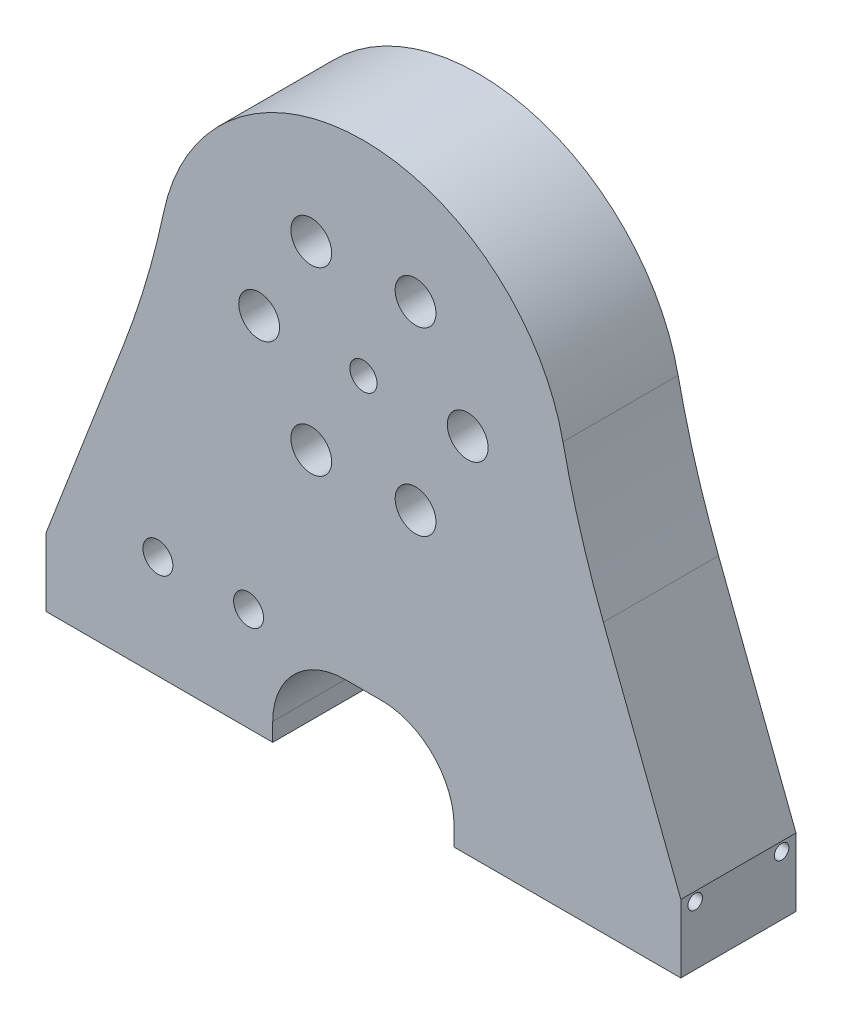
ISO-10303-21;
HEADER;
FILE_DESCRIPTION(('STEP AP214'),'2;1');
FILE_NAME('part.step','',(''),(''),'','','');
FILE_SCHEMA(('AUTOMOTIVE_DESIGN { 1 0 10303 214 1 1 1 1 }'));
ENDSEC;
DATA;
#1=APPLICATION_CONTEXT('core data for automotive mechanical design processes');
#2=APPLICATION_PROTOCOL_DEFINITION('international standard','automotive_design',2000,#1);
#3=PRODUCT_CONTEXT('',#1,'mechanical');
#4=PRODUCT('Part','Part','',(#3));
#5=PRODUCT_RELATED_PRODUCT_CATEGORY('part','',(#4));
#6=PRODUCT_DEFINITION_FORMATION('','',#4);
#7=PRODUCT_DEFINITION_CONTEXT('part definition',#1,'design');
#8=PRODUCT_DEFINITION('design','',#6,#7);
#9=PRODUCT_DEFINITION_SHAPE('','',#8);
#10=(LENGTH_UNIT() NAMED_UNIT(*) SI_UNIT(.MILLI.,.METRE.));
#11=(NAMED_UNIT(*) PLANE_ANGLE_UNIT() SI_UNIT($,.RADIAN.));
#12=(NAMED_UNIT(*) SI_UNIT($,.STERADIAN.) SOLID_ANGLE_UNIT());
#13=UNCERTAINTY_MEASURE_WITH_UNIT(LENGTH_MEASURE(1.E-05),#10,'distance_accuracy_value','');
#14=(GEOMETRIC_REPRESENTATION_CONTEXT(3) GLOBAL_UNCERTAINTY_ASSIGNED_CONTEXT((#13)) GLOBAL_UNIT_ASSIGNED_CONTEXT((#10,
#11,#12)) REPRESENTATION_CONTEXT('',''));
#15=CARTESIAN_POINT('',(0.,0.,0.));
#16=DIRECTION('',(0.,0.,1.));
#17=DIRECTION('',(1.,0.,0.));
#18=AXIS2_PLACEMENT_3D('',#15,#16,#17);
#19=CARTESIAN_POINT('',(35.,-35.,6.35));
#20=DIRECTION('',(0.,1.,0.));
#21=DIRECTION('',(-1.,0.,0.));
#22=AXIS2_PLACEMENT_3D('',#19,#20,#21);
#23=PLANE('',#22);
#24=CARTESIAN_POINT('',(27.5,-35.,0.));
#25=DIRECTION('',(0.,-1.,0.));
#26=DIRECTION('',(0.,0.,-1.));
#27=AXIS2_PLACEMENT_3D('',#24,#25,#26);
#28=CIRCLE('',#27,1.65);
#29=CARTESIAN_POINT('',(27.5,-35.,-1.65));
#30=VERTEX_POINT('',#29);
#31=EDGE_CURVE('E207',#30,#30,#28,.T.);
#32=ORIENTED_EDGE('',*,*,#31,.F.);
#33=EDGE_LOOP('',(#32));
#34=FACE_BOUND('',#33,.T.);
#35=CARTESIAN_POINT('',(17.5,-35.,0.));
#36=DIRECTION('',(0.,-1.,0.));
#37=DIRECTION('',(0.,0.,-1.));
#38=AXIS2_PLACEMENT_3D('',#35,#36,#37);
#39=CIRCLE('',#38,1.65);
#40=CARTESIAN_POINT('',(17.5,-35.,-1.65));
#41=VERTEX_POINT('',#40);
#42=EDGE_CURVE('E213',#41,#41,#39,.T.);
#43=ORIENTED_EDGE('',*,*,#42,.F.);
#44=EDGE_LOOP('',(#43));
#45=FACE_BOUND('',#44,.T.);
#46=DIRECTION('',(1.,0.,0.));
#47=VECTOR('',#46,1.);
#48=CARTESIAN_POINT('',(35.,-35.,6.35));
#49=LINE('',#48,#47);
#50=CARTESIAN_POINT('',(10.,-35.,6.35));
#51=VERTEX_POINT('',#50);
#52=CARTESIAN_POINT('',(35.,-35.,6.35));
#53=VERTEX_POINT('',#52);
#54=EDGE_CURVE('E336',#51,#53,#49,.T.);
#55=ORIENTED_EDGE('',*,*,#54,.F.);
#56=DIRECTION('',(0.,0.,-1.));
#57=VECTOR('',#56,1.);
#58=CARTESIAN_POINT('',(10.,-35.,6.35));
#59=LINE('',#58,#57);
#60=CARTESIAN_POINT('',(10.,-35.,-6.35));
#61=VERTEX_POINT('',#60);
#62=EDGE_CURVE('E246',#51,#61,#59,.T.);
#63=ORIENTED_EDGE('',*,*,#62,.T.);
#64=DIRECTION('',(1.,0.,0.));
#65=VECTOR('',#64,1.);
#66=CARTESIAN_POINT('',(35.,-35.,-6.35));
#67=LINE('',#66,#65);
#68=CARTESIAN_POINT('',(35.,-35.,-6.35));
#69=VERTEX_POINT('',#68);
#70=EDGE_CURVE('E346',#61,#69,#67,.T.);
#71=ORIENTED_EDGE('',*,*,#70,.T.);
#72=DIRECTION('',(0.,0.,-1.));
#73=VECTOR('',#72,1.);
#74=CARTESIAN_POINT('',(35.,-35.,6.35));
#75=LINE('',#74,#73);
#76=EDGE_CURVE('E344',#53,#69,#75,.T.);
#77=ORIENTED_EDGE('',*,*,#76,.F.);
#78=EDGE_LOOP('',(#55,#63,#71,#77));
#79=FACE_BOUND('',#78,.T.);
#80=ADVANCED_FACE('F57',(#34,#45,#79),#23,.F.);
#81=CARTESIAN_POINT('',(35.,-35.,6.35));
#82=DIRECTION('',(-1.,0.,0.));
#83=DIRECTION('',(0.,0.,1.));
#84=AXIS2_PLACEMENT_3D('',#81,#82,#83);
#85=PLANE('',#84);
#86=CARTESIAN_POINT('',(35.,-28.5,4.765));
#87=DIRECTION('',(1.,0.,0.));
#88=DIRECTION('',(0.,0.,-1.));
#89=AXIS2_PLACEMENT_3D('',#86,#87,#88);
#90=CIRCLE('',#89,0.799999999999988);
#91=CARTESIAN_POINT('',(35.,-28.5,3.96500000000001));
#92=VERTEX_POINT('',#91);
#93=EDGE_CURVE('E185',#92,#92,#90,.T.);
#94=ORIENTED_EDGE('',*,*,#93,.F.);
#95=EDGE_LOOP('',(#94));
#96=FACE_BOUND('',#95,.T.);
#97=CARTESIAN_POINT('',(35.,-28.5,-4.765));
#98=DIRECTION('',(1.,0.,0.));
#99=DIRECTION('',(0.,0.,-1.));
#100=AXIS2_PLACEMENT_3D('',#97,#98,#99);
#101=CIRCLE('',#100,0.799999999999988);
#102=CARTESIAN_POINT('',(35.,-28.5,-5.56499999999999));
#103=VERTEX_POINT('',#102);
#104=EDGE_CURVE('E184',#103,#103,#101,.T.);
#105=ORIENTED_EDGE('',*,*,#104,.F.);
#106=EDGE_LOOP('',(#105));
#107=FACE_BOUND('',#106,.T.);
#108=DIRECTION('',(0.,0.,-1.));
#109=VECTOR('',#108,1.);
#110=CARTESIAN_POINT('',(35.,-27.5,6.35));
#111=LINE('',#110,#109);
#112=CARTESIAN_POINT('',(35.,-27.5,6.35));
#113=VERTEX_POINT('',#112);
#114=CARTESIAN_POINT('',(35.,-27.5,-6.35));
#115=VERTEX_POINT('',#114);
#116=EDGE_CURVE('E286',#113,#115,#111,.T.);
#117=ORIENTED_EDGE('',*,*,#116,.F.);
#118=DIRECTION('',(0.,1.,0.));
#119=VECTOR('',#118,1.);
#120=CARTESIAN_POINT('',(35.,-35.,6.35));
#121=LINE('',#120,#119);
#122=EDGE_CURVE('E341',#53,#113,#121,.T.);
#123=ORIENTED_EDGE('',*,*,#122,.F.);
#124=ORIENTED_EDGE('',*,*,#76,.T.);
#125=DIRECTION('',(0.,1.,0.));
#126=VECTOR('',#125,1.);
#127=CARTESIAN_POINT('',(35.,-35.,-6.35));
#128=LINE('',#127,#126);
#129=EDGE_CURVE('E337',#69,#115,#128,.T.);
#130=ORIENTED_EDGE('',*,*,#129,.T.);
#131=EDGE_LOOP('',(#117,#123,#124,#130));
#132=FACE_BOUND('',#131,.T.);
#133=ADVANCED_FACE('F427',(#96,#107,#132),#85,.F.);
#134=CARTESIAN_POINT('',(0.,0.,6.35));
#135=DIRECTION('',(0.,0.,1.));
#136=DIRECTION('',(1.,0.,0.));
#137=AXIS2_PLACEMENT_3D('',#134,#135,#136);
#138=PLANE('',#137);
#139=CARTESIAN_POINT('',(-12.6623879566888,-23.6249999999995,6.35));
#140=DIRECTION('',(0.,0.,-1.));
#141=DIRECTION('',(-1.,0.,0.));
#142=AXIS2_PLACEMENT_3D('',#139,#140,#141);
#143=CIRCLE('',#142,1.65);
#144=CARTESIAN_POINT('',(-14.3123879566888,-23.6249999999995,6.35));
#145=VERTEX_POINT('',#144);
#146=EDGE_CURVE('E198',#145,#145,#143,.T.);
#147=ORIENTED_EDGE('',*,*,#146,.T.);
#148=EDGE_LOOP('',(#147));
#149=FACE_BOUND('',#148,.T.);
#150=CARTESIAN_POINT('',(-22.6623879566888,-23.6249999999995,6.35));
#151=DIRECTION('',(0.,0.,-1.));
#152=DIRECTION('',(-1.,0.,0.));
#153=AXIS2_PLACEMENT_3D('',#150,#151,#152);
#154=CIRCLE('',#153,1.65);
#155=CARTESIAN_POINT('',(-24.3123879566888,-23.6249999999995,6.35));
#156=VERTEX_POINT('',#155);
#157=EDGE_CURVE('E204',#156,#156,#154,.T.);
#158=ORIENTED_EDGE('',*,*,#157,.T.);
#159=EDGE_LOOP('',(#158));
#160=FACE_BOUND('',#159,.T.);
#161=DIRECTION('',(0.,-1.,0.));
#162=VECTOR('',#161,1.);
#163=CARTESIAN_POINT('',(10.,-35.,6.35));
#164=LINE('',#163,#162);
#165=CARTESIAN_POINT('',(10.,-33.,6.35));
#166=VERTEX_POINT('',#165);
#167=EDGE_CURVE('E232',#166,#51,#164,.T.);
#168=ORIENTED_EDGE('',*,*,#167,.T.);
#169=ORIENTED_EDGE('',*,*,#54,.T.);
#170=ORIENTED_EDGE('',*,*,#122,.T.);
#171=DIRECTION('',(0.358979079308869,-0.93334560620306,0.));
#172=VECTOR('',#171,1.);
#173=CARTESIAN_POINT('',(21.2757731958763,8.18298969072165,6.35));
#174=LINE('',#173,#172);
#175=CARTESIAN_POINT('',(26.4605218334639,-5.29735676700612,6.35));
#176=VERTEX_POINT('',#175);
#177=EDGE_CURVE('E278',#176,#113,#174,.T.);
#178=ORIENTED_EDGE('',*,*,#177,.F.);
#179=CARTESIAN_POINT('',(119.79508245377,30.6005511638808,6.35));
#180=DIRECTION('',(0.,0.,1.));
#181=DIRECTION('',(1.,0.,0.));
#182=AXIS2_PLACEMENT_3D('',#179,#180,#181);
#183=CIRCLE('',#182,100.);
#184=CARTESIAN_POINT('',(22.0031784098761,9.70214205050871,6.35));
#185=VERTEX_POINT('',#184);
#186=EDGE_CURVE('E11',#176,#185,#183,.F.);
#187=ORIENTED_EDGE('',*,*,#186,.T.);
#188=CARTESIAN_POINT('',(0.,4.99999999999999,6.35));
#189=DIRECTION('',(0.,0.,-1.));
#190=DIRECTION('',(-1.,0.,0.));
#191=AXIS2_PLACEMENT_3D('',#188,#189,#190);
#192=CIRCLE('',#191,22.5);
#193=CARTESIAN_POINT('',(-22.0031784098761,9.70214205050871,6.35));
#194=VERTEX_POINT('',#193);
#195=EDGE_CURVE('E272',#194,#185,#192,.T.);
#196=ORIENTED_EDGE('',*,*,#195,.F.);
#197=CARTESIAN_POINT('',(-119.79508245377,30.6005511638808,6.35));
#198=DIRECTION('',(0.,0.,1.));
#199=DIRECTION('',(1.,0.,0.));
#200=AXIS2_PLACEMENT_3D('',#197,#198,#199);
#201=CIRCLE('',#200,100.);
#202=CARTESIAN_POINT('',(-26.4605218334639,-5.29735676700612,6.35));
#203=VERTEX_POINT('',#202);
#204=EDGE_CURVE('E368',#194,#203,#201,.F.);
#205=ORIENTED_EDGE('',*,*,#204,.T.);
#206=DIRECTION('',(-0.358979079308869,-0.93334560620306,0.));
#207=VECTOR('',#206,1.);
#208=CARTESIAN_POINT('',(-21.2757731958763,8.18298969072165,6.35));
#209=LINE('',#208,#207);
#210=CARTESIAN_POINT('',(-35.,-27.5,6.35));
#211=VERTEX_POINT('',#210);
#212=EDGE_CURVE('E275',#203,#211,#209,.T.);
#213=ORIENTED_EDGE('',*,*,#212,.T.);
#214=DIRECTION('',(0.,-1.,0.));
#215=VECTOR('',#214,1.);
#216=CARTESIAN_POINT('',(-35.,-35.,6.35));
#217=LINE('',#216,#215);
#218=CARTESIAN_POINT('',(-35.,-35.,6.35));
#219=VERTEX_POINT('',#218);
#220=EDGE_CURVE('E334',#211,#219,#217,.T.);
#221=ORIENTED_EDGE('',*,*,#220,.T.);
#222=CARTESIAN_POINT('',(-10.,-35.,6.35));
#223=VERTEX_POINT('',#222);
#224=EDGE_CURVE('E338',#219,#223,#49,.T.);
#225=ORIENTED_EDGE('',*,*,#224,.T.);
#226=DIRECTION('',(0.,1.,0.));
#227=VECTOR('',#226,1.);
#228=CARTESIAN_POINT('',(-10.,-35.,6.35));
#229=LINE('',#228,#227);
#230=CARTESIAN_POINT('',(-10.,-33.,6.35));
#231=VERTEX_POINT('',#230);
#232=EDGE_CURVE('E72',#223,#231,#229,.T.);
#233=ORIENTED_EDGE('',*,*,#232,.T.);
#234=CARTESIAN_POINT('',(-2.,-33.,6.35));
#235=DIRECTION('',(0.,0.,-1.));
#236=DIRECTION('',(1.,0.,0.));
#237=AXIS2_PLACEMENT_3D('',#234,#235,#236);
#238=CIRCLE('',#237,8.);
#239=CARTESIAN_POINT('',(-2.,-25.,6.35));
#240=VERTEX_POINT('',#239);
#241=EDGE_CURVE('E237',#231,#240,#238,.T.);
#242=ORIENTED_EDGE('',*,*,#241,.T.);
#243=DIRECTION('',(1.,0.,0.));
#244=VECTOR('',#243,1.);
#245=CARTESIAN_POINT('',(2.,-25.,6.35));
#246=LINE('',#245,#244);
#247=CARTESIAN_POINT('',(2.,-25.,6.35));
#248=VERTEX_POINT('',#247);
#249=EDGE_CURVE('E240',#240,#248,#246,.T.);
#250=ORIENTED_EDGE('',*,*,#249,.T.);
#251=CARTESIAN_POINT('',(2.,-33.,6.35));
#252=DIRECTION('',(0.,0.,-1.));
#253=DIRECTION('',(1.,0.,0.));
#254=AXIS2_PLACEMENT_3D('',#251,#252,#253);
#255=CIRCLE('',#254,8.);
#256=EDGE_CURVE('E243',#248,#166,#255,.T.);
#257=ORIENTED_EDGE('',*,*,#256,.T.);
#258=EDGE_LOOP('',(#168,#169,#170,#178,#187,#196,#205,#213,#221,#225,#233,#242,#250,#257));
#259=FACE_BOUND('',#258,.T.);
#260=CARTESIAN_POINT('',(-5.74999999999991,14.9592921435211,6.35));
#261=DIRECTION('',(0.,0.,-1.));
#262=DIRECTION('',(-1.,0.,0.));
#263=AXIS2_PLACEMENT_3D('',#260,#261,#262);
#264=CIRCLE('',#263,2.25);
#265=CARTESIAN_POINT('',(-7.99999999999991,14.9592921435211,6.35));
#266=VERTEX_POINT('',#265);
#267=EDGE_CURVE('E294',#266,#266,#264,.T.);
#268=ORIENTED_EDGE('',*,*,#267,.T.);
#269=EDGE_LOOP('',(#268));
#270=FACE_BOUND('',#269,.T.);
#271=CARTESIAN_POINT('',(5.75000000000012,14.959292143521,6.35));
#272=DIRECTION('',(0.,0.,-1.));
#273=DIRECTION('',(-1.,0.,0.));
#274=AXIS2_PLACEMENT_3D('',#271,#272,#273);
#275=CIRCLE('',#274,2.25);
#276=CARTESIAN_POINT('',(3.50000000000012,14.959292143521,6.35));
#277=VERTEX_POINT('',#276);
#278=EDGE_CURVE('E300',#277,#277,#275,.T.);
#279=ORIENTED_EDGE('',*,*,#278,.T.);
#280=EDGE_LOOP('',(#279));
#281=FACE_BOUND('',#280,.T.);
#282=CARTESIAN_POINT('',(11.5,4.99999999999998,6.35));
#283=DIRECTION('',(0.,0.,-1.));
#284=DIRECTION('',(-1.,0.,0.));
#285=AXIS2_PLACEMENT_3D('',#282,#283,#284);
#286=CIRCLE('',#285,2.25);
#287=CARTESIAN_POINT('',(9.25,4.99999999999998,6.35));
#288=VERTEX_POINT('',#287);
#289=EDGE_CURVE('E306',#288,#288,#286,.T.);
#290=ORIENTED_EDGE('',*,*,#289,.T.);
#291=EDGE_LOOP('',(#290));
#292=FACE_BOUND('',#291,.T.);
#293=CARTESIAN_POINT('',(5.75,-4.95929214352108,6.35));
#294=DIRECTION('',(0.,0.,-1.));
#295=DIRECTION('',(-1.,0.,0.));
#296=AXIS2_PLACEMENT_3D('',#293,#294,#295);
#297=CIRCLE('',#296,2.25);
#298=CARTESIAN_POINT('',(3.5,-4.95929214352108,6.35));
#299=VERTEX_POINT('',#298);
#300=EDGE_CURVE('E312',#299,#299,#297,.T.);
#301=ORIENTED_EDGE('',*,*,#300,.T.);
#302=EDGE_LOOP('',(#301));
#303=FACE_BOUND('',#302,.T.);
#304=CARTESIAN_POINT('',(-5.75,-4.95929214352104,6.35));
#305=DIRECTION('',(0.,0.,-1.));
#306=DIRECTION('',(-1.,0.,0.));
#307=AXIS2_PLACEMENT_3D('',#304,#305,#306);
#308=CIRCLE('',#307,2.25);
#309=CARTESIAN_POINT('',(-8.,-4.95929214352104,6.35));
#310=VERTEX_POINT('',#309);
#311=EDGE_CURVE('E318',#310,#310,#308,.T.);
#312=ORIENTED_EDGE('',*,*,#311,.T.);
#313=EDGE_LOOP('',(#312));
#314=FACE_BOUND('',#313,.T.);
#315=CARTESIAN_POINT('',(-11.5,5.00000000000006,6.35));
#316=DIRECTION('',(0.,0.,-1.));
#317=DIRECTION('',(-1.,0.,0.));
#318=AXIS2_PLACEMENT_3D('',#315,#316,#317);
#319=CIRCLE('',#318,2.25);
#320=CARTESIAN_POINT('',(-13.75,5.00000000000006,6.35));
#321=VERTEX_POINT('',#320);
#322=EDGE_CURVE('E324',#321,#321,#319,.T.);
#323=ORIENTED_EDGE('',*,*,#322,.T.);
#324=EDGE_LOOP('',(#323));
#325=FACE_BOUND('',#324,.T.);
#326=CARTESIAN_POINT('',(0.,4.99999999999999,6.35));
#327=DIRECTION('',(0.,0.,-1.));
#328=DIRECTION('',(-1.,0.,0.));
#329=AXIS2_PLACEMENT_3D('',#326,#327,#328);
#330=CIRCLE('',#329,1.5);
#331=CARTESIAN_POINT('',(-1.5,4.99999999999999,6.35));
#332=VERTEX_POINT('',#331);
#333=EDGE_CURVE('E328',#332,#332,#330,.T.);
#334=ORIENTED_EDGE('',*,*,#333,.T.);
#335=EDGE_LOOP('',(#334));
#336=FACE_BOUND('',#335,.T.);
#337=ADVANCED_FACE('F381',(#149,#160,#259,#270,#281,#292,#303,#314,#325,#336),#138,.T.);
#338=CARTESIAN_POINT('',(0.,0.,-6.35));
#339=DIRECTION('',(0.,0.,1.));
#340=DIRECTION('',(1.,0.,0.));
#341=AXIS2_PLACEMENT_3D('',#338,#339,#340);
#342=PLANE('',#341);
#343=CARTESIAN_POINT('',(-12.6623879566888,-23.6249999999995,-6.35));
#344=DIRECTION('',(0.,0.,-1.));
#345=DIRECTION('',(-1.,0.,0.));
#346=AXIS2_PLACEMENT_3D('',#343,#344,#345);
#347=CIRCLE('',#346,1.65);
#348=CARTESIAN_POINT('',(-14.3123879566888,-23.6249999999995,-6.35));
#349=VERTEX_POINT('',#348);
#350=EDGE_CURVE('E195',#349,#349,#347,.T.);
#351=ORIENTED_EDGE('',*,*,#350,.F.);
#352=EDGE_LOOP('',(#351));
#353=FACE_BOUND('',#352,.T.);
#354=CARTESIAN_POINT('',(-22.6623879566888,-23.6249999999995,-6.35));
#355=DIRECTION('',(0.,0.,-1.));
#356=DIRECTION('',(-1.,0.,0.));
#357=AXIS2_PLACEMENT_3D('',#354,#355,#356);
#358=CIRCLE('',#357,1.65);
#359=CARTESIAN_POINT('',(-24.3123879566888,-23.6249999999995,-6.35));
#360=VERTEX_POINT('',#359);
#361=EDGE_CURVE('E201',#360,#360,#358,.T.);
#362=ORIENTED_EDGE('',*,*,#361,.F.);
#363=EDGE_LOOP('',(#362));
#364=FACE_BOUND('',#363,.T.);
#365=CARTESIAN_POINT('',(0.,4.99999999999999,-6.35));
#366=DIRECTION('',(0.,0.,-1.));
#367=DIRECTION('',(-1.,0.,0.));
#368=AXIS2_PLACEMENT_3D('',#365,#366,#367);
#369=CIRCLE('',#368,1.5);
#370=CARTESIAN_POINT('',(-1.5,4.99999999999999,-6.35));
#371=VERTEX_POINT('',#370);
#372=EDGE_CURVE('E327',#371,#371,#369,.T.);
#373=ORIENTED_EDGE('',*,*,#372,.F.);
#374=EDGE_LOOP('',(#373));
#375=FACE_BOUND('',#374,.T.);
#376=CARTESIAN_POINT('',(-11.5,5.00000000000006,-6.35));
#377=DIRECTION('',(0.,0.,-1.));
#378=DIRECTION('',(-1.,0.,0.));
#379=AXIS2_PLACEMENT_3D('',#376,#377,#378);
#380=CIRCLE('',#379,2.24999999999999);
#381=CARTESIAN_POINT('',(-13.75,5.00000000000006,-6.35));
#382=VERTEX_POINT('',#381);
#383=EDGE_CURVE('E321',#382,#382,#380,.T.);
#384=ORIENTED_EDGE('',*,*,#383,.F.);
#385=EDGE_LOOP('',(#384));
#386=FACE_BOUND('',#385,.T.);
#387=CARTESIAN_POINT('',(-5.75,-4.95929214352104,-6.35));
#388=DIRECTION('',(0.,0.,-1.));
#389=DIRECTION('',(-1.,0.,0.));
#390=AXIS2_PLACEMENT_3D('',#387,#388,#389);
#391=CIRCLE('',#390,2.24999999999999);
#392=CARTESIAN_POINT('',(-7.99999999999999,-4.95929214352104,-6.35));
#393=VERTEX_POINT('',#392);
#394=EDGE_CURVE('E315',#393,#393,#391,.T.);
#395=ORIENTED_EDGE('',*,*,#394,.F.);
#396=EDGE_LOOP('',(#395));
#397=FACE_BOUND('',#396,.T.);
#398=CARTESIAN_POINT('',(5.75,-4.95929214352108,-6.35));
#399=DIRECTION('',(0.,0.,-1.));
#400=DIRECTION('',(-1.,0.,0.));
#401=AXIS2_PLACEMENT_3D('',#398,#399,#400);
#402=CIRCLE('',#401,2.24999999999999);
#403=CARTESIAN_POINT('',(3.50000000000001,-4.95929214352108,-6.35));
#404=VERTEX_POINT('',#403);
#405=EDGE_CURVE('E309',#404,#404,#402,.T.);
#406=ORIENTED_EDGE('',*,*,#405,.F.);
#407=EDGE_LOOP('',(#406));
#408=FACE_BOUND('',#407,.T.);
#409=CARTESIAN_POINT('',(11.5,4.99999999999998,-6.35));
#410=DIRECTION('',(0.,0.,-1.));
#411=DIRECTION('',(-1.,0.,0.));
#412=AXIS2_PLACEMENT_3D('',#409,#410,#411);
#413=CIRCLE('',#412,2.24999999999999);
#414=CARTESIAN_POINT('',(9.25000000000001,4.99999999999998,-6.35));
#415=VERTEX_POINT('',#414);
#416=EDGE_CURVE('E303',#415,#415,#413,.T.);
#417=ORIENTED_EDGE('',*,*,#416,.F.);
#418=EDGE_LOOP('',(#417));
#419=FACE_BOUND('',#418,.T.);
#420=CARTESIAN_POINT('',(5.75000000000012,14.959292143521,-6.35));
#421=DIRECTION('',(0.,0.,-1.));
#422=DIRECTION('',(-1.,0.,0.));
#423=AXIS2_PLACEMENT_3D('',#420,#421,#422);
#424=CIRCLE('',#423,2.24999999999999);
#425=CARTESIAN_POINT('',(3.50000000000013,14.959292143521,-6.35));
#426=VERTEX_POINT('',#425);
#427=EDGE_CURVE('E297',#426,#426,#424,.T.);
#428=ORIENTED_EDGE('',*,*,#427,.F.);
#429=EDGE_LOOP('',(#428));
#430=FACE_BOUND('',#429,.T.);
#431=CARTESIAN_POINT('',(-5.74999999999991,14.9592921435211,-6.35));
#432=DIRECTION('',(0.,0.,-1.));
#433=DIRECTION('',(-1.,0.,0.));
#434=AXIS2_PLACEMENT_3D('',#431,#432,#433);
#435=CIRCLE('',#434,2.24999999999999);
#436=CARTESIAN_POINT('',(-7.9999999999999,14.9592921435211,-6.35));
#437=VERTEX_POINT('',#436);
#438=EDGE_CURVE('E289',#437,#437,#435,.T.);
#439=ORIENTED_EDGE('',*,*,#438,.F.);
#440=EDGE_LOOP('',(#439));
#441=FACE_BOUND('',#440,.T.);
#442=ORIENTED_EDGE('',*,*,#70,.F.);
#443=DIRECTION('',(0.,-1.,0.));
#444=VECTOR('',#443,1.);
#445=CARTESIAN_POINT('',(10.,-35.,-6.35));
#446=LINE('',#445,#444);
#447=CARTESIAN_POINT('',(10.,-33.,-6.35));
#448=VERTEX_POINT('',#447);
#449=EDGE_CURVE('E231',#448,#61,#446,.T.);
#450=ORIENTED_EDGE('',*,*,#449,.F.);
#451=CARTESIAN_POINT('',(2.,-33.,-6.35));
#452=DIRECTION('',(0.,0.,-1.));
#453=DIRECTION('',(1.,0.,0.));
#454=AXIS2_PLACEMENT_3D('',#451,#452,#453);
#455=CIRCLE('',#454,8.);
#456=CARTESIAN_POINT('',(2.,-25.,-6.35));
#457=VERTEX_POINT('',#456);
#458=EDGE_CURVE('E235',#457,#448,#455,.T.);
#459=ORIENTED_EDGE('',*,*,#458,.F.);
#460=DIRECTION('',(1.,0.,0.));
#461=VECTOR('',#460,1.);
#462=CARTESIAN_POINT('',(2.,-25.,-6.35));
#463=LINE('',#462,#461);
#464=CARTESIAN_POINT('',(-2.,-25.,-6.35));
#465=VERTEX_POINT('',#464);
#466=EDGE_CURVE('E254',#465,#457,#463,.T.);
#467=ORIENTED_EDGE('',*,*,#466,.F.);
#468=CARTESIAN_POINT('',(-2.,-33.,-6.35));
#469=DIRECTION('',(0.,0.,-1.));
#470=DIRECTION('',(1.,0.,0.));
#471=AXIS2_PLACEMENT_3D('',#468,#469,#470);
#472=CIRCLE('',#471,8.);
#473=CARTESIAN_POINT('',(-10.,-33.,-6.35));
#474=VERTEX_POINT('',#473);
#475=EDGE_CURVE('E251',#474,#465,#472,.T.);
#476=ORIENTED_EDGE('',*,*,#475,.F.);
#477=DIRECTION('',(0.,1.,0.));
#478=VECTOR('',#477,1.);
#479=CARTESIAN_POINT('',(-10.,-35.,-6.35));
#480=LINE('',#479,#478);
#481=CARTESIAN_POINT('',(-10.,-35.,-6.35));
#482=VERTEX_POINT('',#481);
#483=EDGE_CURVE('E248',#482,#474,#480,.T.);
#484=ORIENTED_EDGE('',*,*,#483,.F.);
#485=CARTESIAN_POINT('',(-35.,-35.,-6.35));
#486=VERTEX_POINT('',#485);
#487=EDGE_CURVE('E347',#486,#482,#67,.T.);
#488=ORIENTED_EDGE('',*,*,#487,.F.);
#489=DIRECTION('',(0.,-1.,0.));
#490=VECTOR('',#489,1.);
#491=CARTESIAN_POINT('',(-35.,-35.,-6.35));
#492=LINE('',#491,#490);
#493=CARTESIAN_POINT('',(-35.,-27.5,-6.35));
#494=VERTEX_POINT('',#493);
#495=EDGE_CURVE('E331',#494,#486,#492,.T.);
#496=ORIENTED_EDGE('',*,*,#495,.F.);
#497=DIRECTION('',(-0.358979079308869,-0.93334560620306,0.));
#498=VECTOR('',#497,1.);
#499=CARTESIAN_POINT('',(-21.2757731958763,8.18298969072165,-6.35));
#500=LINE('',#499,#498);
#501=CARTESIAN_POINT('',(-26.4605218334639,-5.29735676700612,-6.35));
#502=VERTEX_POINT('',#501);
#503=EDGE_CURVE('E283',#502,#494,#500,.T.);
#504=ORIENTED_EDGE('',*,*,#503,.F.);
#505=CARTESIAN_POINT('',(-119.79508245377,30.6005511638808,-6.35));
#506=DIRECTION('',(0.,0.,1.));
#507=DIRECTION('',(1.,0.,0.));
#508=AXIS2_PLACEMENT_3D('',#505,#506,#507);
#509=CIRCLE('',#508,100.);
#510=CARTESIAN_POINT('',(-22.0031784098761,9.70214205050871,-6.35));
#511=VERTEX_POINT('',#510);
#512=EDGE_CURVE('E366',#502,#511,#509,.T.);
#513=ORIENTED_EDGE('',*,*,#512,.T.);
#514=CARTESIAN_POINT('',(0.,4.99999999999999,-6.35));
#515=DIRECTION('',(0.,0.,-1.));
#516=DIRECTION('',(-1.,0.,0.));
#517=AXIS2_PLACEMENT_3D('',#514,#515,#516);
#518=CIRCLE('',#517,22.5);
#519=CARTESIAN_POINT('',(22.0031784098761,9.70214205050871,-6.35));
#520=VERTEX_POINT('',#519);
#521=EDGE_CURVE('E261',#511,#520,#518,.T.);
#522=ORIENTED_EDGE('',*,*,#521,.T.);
#523=CARTESIAN_POINT('',(119.79508245377,30.6005511638808,-6.35));
#524=DIRECTION('',(0.,0.,1.));
#525=DIRECTION('',(1.,0.,0.));
#526=AXIS2_PLACEMENT_3D('',#523,#524,#525);
#527=CIRCLE('',#526,100.);
#528=CARTESIAN_POINT('',(26.4605218334639,-5.29735676700612,-6.35));
#529=VERTEX_POINT('',#528);
#530=EDGE_CURVE('E65',#520,#529,#527,.T.);
#531=ORIENTED_EDGE('',*,*,#530,.T.);
#532=DIRECTION('',(0.358979079308869,-0.93334560620306,0.));
#533=VECTOR('',#532,1.);
#534=CARTESIAN_POINT('',(21.2757731958763,8.18298969072165,-6.35));
#535=LINE('',#534,#533);
#536=EDGE_CURVE('E276',#529,#115,#535,.T.);
#537=ORIENTED_EDGE('',*,*,#536,.T.);
#538=ORIENTED_EDGE('',*,*,#129,.F.);
#539=EDGE_LOOP('',(#442,#450,#459,#467,#476,#484,#488,#496,#504,#513,#522,#531,#537,#538));
#540=FACE_BOUND('',#539,.T.);
#541=ADVANCED_FACE('F371',(#353,#364,#375,#386,#397,#408,#419,#430,#441,#540),#342,.F.);
#542=CARTESIAN_POINT('',(-35.,-35.,6.35));
#543=DIRECTION('',(1.,0.,0.));
#544=DIRECTION('',(0.,0.,-1.));
#545=AXIS2_PLACEMENT_3D('',#542,#543,#544);
#546=PLANE('',#545);
#547=ORIENTED_EDGE('',*,*,#220,.F.);
#548=DIRECTION('',(0.,0.,-1.));
#549=VECTOR('',#548,1.);
#550=CARTESIAN_POINT('',(-35.,-27.5,6.35));
#551=LINE('',#550,#549);
#552=EDGE_CURVE('E280',#211,#494,#551,.T.);
#553=ORIENTED_EDGE('',*,*,#552,.T.);
#554=ORIENTED_EDGE('',*,*,#495,.T.);
#555=DIRECTION('',(0.,0.,-1.));
#556=VECTOR('',#555,1.);
#557=CARTESIAN_POINT('',(-35.,-35.,6.35));
#558=LINE('',#557,#556);
#559=EDGE_CURVE('E354',#219,#486,#558,.T.);
#560=ORIENTED_EDGE('',*,*,#559,.F.);
#561=EDGE_LOOP('',(#547,#553,#554,#560));
#562=FACE_BOUND('',#561,.T.);
#563=ADVANCED_FACE('F399',(#562),#546,.F.);
#564=CARTESIAN_POINT('',(-17.5,-35.,0.));
#565=DIRECTION('',(0.,-1.,0.));
#566=DIRECTION('',(0.,0.,-1.));
#567=AXIS2_PLACEMENT_3D('',#564,#565,#566);
#568=CIRCLE('',#567,1.65);
#569=CARTESIAN_POINT('',(-17.5,-35.,-1.65));
#570=VERTEX_POINT('',#569);
#571=EDGE_CURVE('E219',#570,#570,#568,.T.);
#572=ORIENTED_EDGE('',*,*,#571,.F.);
#573=EDGE_LOOP('',(#572));
#574=FACE_BOUND('',#573,.T.);
#575=CARTESIAN_POINT('',(-27.5,-35.,0.));
#576=DIRECTION('',(0.,-1.,0.));
#577=DIRECTION('',(0.,0.,-1.));
#578=AXIS2_PLACEMENT_3D('',#575,#576,#577);
#579=CIRCLE('',#578,1.65);
#580=CARTESIAN_POINT('',(-27.5,-35.,-1.65));
#581=VERTEX_POINT('',#580);
#582=EDGE_CURVE('E225',#581,#581,#579,.T.);
#583=ORIENTED_EDGE('',*,*,#582,.F.);
#584=EDGE_LOOP('',(#583));
#585=FACE_BOUND('',#584,.T.);
#586=ORIENTED_EDGE('',*,*,#487,.T.);
#587=DIRECTION('',(0.,0.,-1.));
#588=VECTOR('',#587,1.);
#589=CARTESIAN_POINT('',(-10.,-35.,6.35));
#590=LINE('',#589,#588);
#591=EDGE_CURVE('E268',#223,#482,#590,.T.);
#592=ORIENTED_EDGE('',*,*,#591,.F.);
#593=ORIENTED_EDGE('',*,*,#224,.F.);
#594=ORIENTED_EDGE('',*,*,#559,.T.);
#595=EDGE_LOOP('',(#586,#592,#593,#594));
#596=FACE_BOUND('',#595,.T.);
#597=ADVANCED_FACE('F402',(#574,#585,#596),#23,.F.);
#598=CARTESIAN_POINT('',(0.,4.99999999999999,6.35));
#599=DIRECTION('',(0.,0.,-1.));
#600=DIRECTION('',(-1.,0.,0.));
#601=AXIS2_PLACEMENT_3D('',#598,#599,#600);
#602=CYLINDRICAL_SURFACE('',#601,1.5);
#603=ORIENTED_EDGE('',*,*,#333,.F.);
#604=EDGE_LOOP('',(#603));
#605=FACE_BOUND('',#604,.T.);
#606=ORIENTED_EDGE('',*,*,#372,.T.);
#607=EDGE_LOOP('',(#606));
#608=FACE_BOUND('',#607,.T.);
#609=ADVANCED_FACE('F445',(#605,#608),#602,.F.);
#610=CARTESIAN_POINT('',(-11.5,5.00000000000006,-6.35));
#611=DIRECTION('',(0.,0.,-1.));
#612=DIRECTION('',(-1.,0.,0.));
#613=AXIS2_PLACEMENT_3D('',#610,#611,#612);
#614=CYLINDRICAL_SURFACE('',#613,2.24999999999999);
#615=ORIENTED_EDGE('',*,*,#322,.F.);
#616=EDGE_LOOP('',(#615));
#617=FACE_BOUND('',#616,.T.);
#618=ORIENTED_EDGE('',*,*,#383,.T.);
#619=EDGE_LOOP('',(#618));
#620=FACE_BOUND('',#619,.T.);
#621=ADVANCED_FACE('F481',(#617,#620),#614,.F.);
#622=CARTESIAN_POINT('',(-5.75,-4.95929214352104,-6.35));
#623=DIRECTION('',(0.,0.,-1.));
#624=DIRECTION('',(-1.,0.,0.));
#625=AXIS2_PLACEMENT_3D('',#622,#623,#624);
#626=CYLINDRICAL_SURFACE('',#625,2.24999999999999);
#627=ORIENTED_EDGE('',*,*,#311,.F.);
#628=EDGE_LOOP('',(#627));
#629=FACE_BOUND('',#628,.T.);
#630=ORIENTED_EDGE('',*,*,#394,.T.);
#631=EDGE_LOOP('',(#630));
#632=FACE_BOUND('',#631,.T.);
#633=ADVANCED_FACE('F477',(#629,#632),#626,.F.);
#634=CARTESIAN_POINT('',(5.75,-4.95929214352108,-6.35));
#635=DIRECTION('',(0.,0.,-1.));
#636=DIRECTION('',(-1.,0.,0.));
#637=AXIS2_PLACEMENT_3D('',#634,#635,#636);
#638=CYLINDRICAL_SURFACE('',#637,2.24999999999999);
#639=ORIENTED_EDGE('',*,*,#300,.F.);
#640=EDGE_LOOP('',(#639));
#641=FACE_BOUND('',#640,.T.);
#642=ORIENTED_EDGE('',*,*,#405,.T.);
#643=EDGE_LOOP('',(#642));
#644=FACE_BOUND('',#643,.T.);
#645=ADVANCED_FACE('F473',(#641,#644),#638,.F.);
#646=CARTESIAN_POINT('',(11.5,4.99999999999998,-6.35));
#647=DIRECTION('',(0.,0.,-1.));
#648=DIRECTION('',(-1.,0.,0.));
#649=AXIS2_PLACEMENT_3D('',#646,#647,#648);
#650=CYLINDRICAL_SURFACE('',#649,2.24999999999999);
#651=ORIENTED_EDGE('',*,*,#289,.F.);
#652=EDGE_LOOP('',(#651));
#653=FACE_BOUND('',#652,.T.);
#654=ORIENTED_EDGE('',*,*,#416,.T.);
#655=EDGE_LOOP('',(#654));
#656=FACE_BOUND('',#655,.T.);
#657=ADVANCED_FACE('F469',(#653,#656),#650,.F.);
#658=CARTESIAN_POINT('',(5.75000000000012,14.959292143521,-6.35));
#659=DIRECTION('',(0.,0.,-1.));
#660=DIRECTION('',(-1.,0.,0.));
#661=AXIS2_PLACEMENT_3D('',#658,#659,#660);
#662=CYLINDRICAL_SURFACE('',#661,2.24999999999999);
#663=ORIENTED_EDGE('',*,*,#278,.F.);
#664=EDGE_LOOP('',(#663));
#665=FACE_BOUND('',#664,.T.);
#666=ORIENTED_EDGE('',*,*,#427,.T.);
#667=EDGE_LOOP('',(#666));
#668=FACE_BOUND('',#667,.T.);
#669=ADVANCED_FACE('F465',(#665,#668),#662,.F.);
#670=CARTESIAN_POINT('',(-5.74999999999991,14.9592921435211,-6.35));
#671=DIRECTION('',(0.,0.,-1.));
#672=DIRECTION('',(-1.,0.,0.));
#673=AXIS2_PLACEMENT_3D('',#670,#671,#672);
#674=CYLINDRICAL_SURFACE('',#673,2.24999999999999);
#675=ORIENTED_EDGE('',*,*,#267,.F.);
#676=EDGE_LOOP('',(#675));
#677=FACE_BOUND('',#676,.T.);
#678=ORIENTED_EDGE('',*,*,#438,.T.);
#679=EDGE_LOOP('',(#678));
#680=FACE_BOUND('',#679,.T.);
#681=ADVANCED_FACE('F462',(#677,#680),#674,.F.);
#682=CARTESIAN_POINT('',(0.,4.99999999999999,6.35));
#683=DIRECTION('',(0.,0.,-1.));
#684=DIRECTION('',(-1.,0.,0.));
#685=AXIS2_PLACEMENT_3D('',#682,#683,#684);
#686=CYLINDRICAL_SURFACE('',#685,22.5);
#687=ORIENTED_EDGE('',*,*,#521,.F.);
#688=DIRECTION('',(0.,0.,-1.));
#689=VECTOR('',#688,1.);
#690=CARTESIAN_POINT('',(-22.0031784098761,9.70214205050871,6.35));
#691=LINE('',#690,#689);
#692=EDGE_CURVE('E363',#511,#194,#691,.F.);
#693=ORIENTED_EDGE('',*,*,#692,.T.);
#694=ORIENTED_EDGE('',*,*,#195,.T.);
#695=DIRECTION('',(0.,0.,-1.));
#696=VECTOR('',#695,1.);
#697=CARTESIAN_POINT('',(22.0031784098761,9.70214205050871,6.35));
#698=LINE('',#697,#696);
#699=EDGE_CURVE('E360',#185,#520,#698,.T.);
#700=ORIENTED_EDGE('',*,*,#699,.T.);
#701=EDGE_LOOP('',(#687,#693,#694,#700));
#702=FACE_BOUND('',#701,.T.);
#703=ADVANCED_FACE('F385',(#702),#686,.T.);
#704=CARTESIAN_POINT('',(21.2757731958763,8.18298969072165,6.35));
#705=DIRECTION('',(0.93334560620306,0.358979079308869,0.));
#706=DIRECTION('',(-0.358979079308869,0.93334560620306,0.));
#707=AXIS2_PLACEMENT_3D('',#704,#705,#706);
#708=PLANE('',#707);
#709=ORIENTED_EDGE('',*,*,#536,.F.);
#710=DIRECTION('',(0.,0.,1.));
#711=VECTOR('',#710,1.);
#712=CARTESIAN_POINT('',(26.4605218334639,-5.29735676700613,6.35));
#713=LINE('',#712,#711);
#714=EDGE_CURVE('E80',#529,#176,#713,.T.);
#715=ORIENTED_EDGE('',*,*,#714,.T.);
#716=ORIENTED_EDGE('',*,*,#177,.T.);
#717=ORIENTED_EDGE('',*,*,#116,.T.);
#718=EDGE_LOOP('',(#709,#715,#716,#717));
#719=FACE_BOUND('',#718,.T.);
#720=ADVANCED_FACE('F376',(#719),#708,.T.);
#721=CARTESIAN_POINT('',(-21.2757731958763,8.18298969072165,6.35));
#722=DIRECTION('',(0.93334560620306,-0.358979079308869,0.));
#723=DIRECTION('',(0.358979079308869,0.93334560620306,0.));
#724=AXIS2_PLACEMENT_3D('',#721,#722,#723);
#725=PLANE('',#724);
#726=ORIENTED_EDGE('',*,*,#212,.F.);
#727=DIRECTION('',(0.,0.,-1.));
#728=VECTOR('',#727,1.);
#729=CARTESIAN_POINT('',(-26.4605218334639,-5.29735676700612,6.35));
#730=LINE('',#729,#728);
#731=EDGE_CURVE('E357',#203,#502,#730,.T.);
#732=ORIENTED_EDGE('',*,*,#731,.T.);
#733=ORIENTED_EDGE('',*,*,#503,.T.);
#734=ORIENTED_EDGE('',*,*,#552,.F.);
#735=EDGE_LOOP('',(#726,#732,#733,#734));
#736=FACE_BOUND('',#735,.T.);
#737=ADVANCED_FACE('F393',(#736),#725,.F.);
#738=CARTESIAN_POINT('',(-119.79508245377,30.6005511638808,6.35));
#739=DIRECTION('',(0.,0.,-1.));
#740=DIRECTION('',(-1.,0.,0.));
#741=AXIS2_PLACEMENT_3D('',#738,#739,#740);
#742=CYLINDRICAL_SURFACE('',#741,100.);
#743=ORIENTED_EDGE('',*,*,#204,.F.);
#744=ORIENTED_EDGE('',*,*,#692,.F.);
#745=ORIENTED_EDGE('',*,*,#512,.F.);
#746=ORIENTED_EDGE('',*,*,#731,.F.);
#747=EDGE_LOOP('',(#743,#744,#745,#746));
#748=FACE_BOUND('',#747,.T.);
#749=ADVANCED_FACE('F388',(#748),#742,.F.);
#750=CARTESIAN_POINT('',(119.79508245377,30.6005511638808,6.35));
#751=DIRECTION('',(0.,0.,-1.));
#752=DIRECTION('',(-1.,0.,0.));
#753=AXIS2_PLACEMENT_3D('',#750,#751,#752);
#754=CYLINDRICAL_SURFACE('',#753,100.);
#755=ORIENTED_EDGE('',*,*,#186,.F.);
#756=ORIENTED_EDGE('',*,*,#714,.F.);
#757=ORIENTED_EDGE('',*,*,#530,.F.);
#758=ORIENTED_EDGE('',*,*,#699,.F.);
#759=EDGE_LOOP('',(#755,#756,#757,#758));
#760=FACE_BOUND('',#759,.T.);
#761=ADVANCED_FACE('F59',(#760),#754,.F.);
#762=CARTESIAN_POINT('',(10.,-35.,6.35));
#763=DIRECTION('',(1.,0.,0.));
#764=DIRECTION('',(0.,0.,-1.));
#765=AXIS2_PLACEMENT_3D('',#762,#763,#764);
#766=PLANE('',#765);
#767=ORIENTED_EDGE('',*,*,#449,.T.);
#768=ORIENTED_EDGE('',*,*,#62,.F.);
#769=ORIENTED_EDGE('',*,*,#167,.F.);
#770=DIRECTION('',(0.,0.,-1.));
#771=VECTOR('',#770,1.);
#772=CARTESIAN_POINT('',(10.,-33.,6.35));
#773=LINE('',#772,#771);
#774=EDGE_CURVE('E259',#166,#448,#773,.T.);
#775=ORIENTED_EDGE('',*,*,#774,.T.);
#776=EDGE_LOOP('',(#767,#768,#769,#775));
#777=FACE_BOUND('',#776,.T.);
#778=ADVANCED_FACE('F421',(#777),#766,.F.);
#779=CARTESIAN_POINT('',(2.,-33.,6.35));
#780=DIRECTION('',(0.,0.,-1.));
#781=DIRECTION('',(-1.,0.,0.));
#782=AXIS2_PLACEMENT_3D('',#779,#780,#781);
#783=CYLINDRICAL_SURFACE('',#782,8.);
#784=ORIENTED_EDGE('',*,*,#458,.T.);
#785=ORIENTED_EDGE('',*,*,#774,.F.);
#786=ORIENTED_EDGE('',*,*,#256,.F.);
#787=DIRECTION('',(0.,0.,-1.));
#788=VECTOR('',#787,1.);
#789=CARTESIAN_POINT('',(2.,-25.,6.35));
#790=LINE('',#789,#788);
#791=EDGE_CURVE('E262',#248,#457,#790,.T.);
#792=ORIENTED_EDGE('',*,*,#791,.T.);
#793=EDGE_LOOP('',(#784,#785,#786,#792));
#794=FACE_BOUND('',#793,.T.);
#795=ADVANCED_FACE('F417',(#794),#783,.F.);
#796=CARTESIAN_POINT('',(2.,-25.,6.35));
#797=DIRECTION('',(0.,1.,0.));
#798=DIRECTION('',(0.,0.,1.));
#799=AXIS2_PLACEMENT_3D('',#796,#797,#798);
#800=PLANE('',#799);
#801=ORIENTED_EDGE('',*,*,#466,.T.);
#802=ORIENTED_EDGE('',*,*,#791,.F.);
#803=ORIENTED_EDGE('',*,*,#249,.F.);
#804=DIRECTION('',(0.,0.,-1.));
#805=VECTOR('',#804,1.);
#806=CARTESIAN_POINT('',(-2.,-25.,6.35));
#807=LINE('',#806,#805);
#808=EDGE_CURVE('E264',#240,#465,#807,.T.);
#809=ORIENTED_EDGE('',*,*,#808,.T.);
#810=EDGE_LOOP('',(#801,#802,#803,#809));
#811=FACE_BOUND('',#810,.T.);
#812=ADVANCED_FACE('F415',(#811),#800,.F.);
#813=CARTESIAN_POINT('',(-2.,-33.,6.35));
#814=DIRECTION('',(0.,0.,-1.));
#815=DIRECTION('',(-1.,0.,0.));
#816=AXIS2_PLACEMENT_3D('',#813,#814,#815);
#817=CYLINDRICAL_SURFACE('',#816,8.);
#818=ORIENTED_EDGE('',*,*,#475,.T.);
#819=ORIENTED_EDGE('',*,*,#808,.F.);
#820=ORIENTED_EDGE('',*,*,#241,.F.);
#821=DIRECTION('',(0.,0.,-1.));
#822=VECTOR('',#821,1.);
#823=CARTESIAN_POINT('',(-10.,-33.,6.35));
#824=LINE('',#823,#822);
#825=EDGE_CURVE('E266',#231,#474,#824,.T.);
#826=ORIENTED_EDGE('',*,*,#825,.T.);
#827=EDGE_LOOP('',(#818,#819,#820,#826));
#828=FACE_BOUND('',#827,.T.);
#829=ADVANCED_FACE('F410',(#828),#817,.F.);
#830=CARTESIAN_POINT('',(-10.,-35.,6.35));
#831=DIRECTION('',(-1.,0.,0.));
#832=DIRECTION('',(0.,0.,1.));
#833=AXIS2_PLACEMENT_3D('',#830,#831,#832);
#834=PLANE('',#833);
#835=ORIENTED_EDGE('',*,*,#483,.T.);
#836=ORIENTED_EDGE('',*,*,#825,.F.);
#837=ORIENTED_EDGE('',*,*,#232,.F.);
#838=ORIENTED_EDGE('',*,*,#591,.T.);
#839=EDGE_LOOP('',(#835,#836,#837,#838));
#840=FACE_BOUND('',#839,.T.);
#841=ADVANCED_FACE('F405',(#840),#834,.F.);
#842=CARTESIAN_POINT('',(-27.5,-22.,0.));
#843=DIRECTION('',(0.,-1.,0.));
#844=DIRECTION('',(0.,0.,-1.));
#845=AXIS2_PLACEMENT_3D('',#842,#843,#844);
#846=CONICAL_SURFACE('',#845,1.65,1.02974425867665);
#847=CARTESIAN_POINT('',(-27.5,-21.0085799786045,0.));
#848=VERTEX_POINT('',#847);
#849=VERTEX_LOOP('',#848);
#850=FACE_BOUND('',#849,.T.);
#851=CARTESIAN_POINT('',(-27.5,-22.,0.));
#852=DIRECTION('',(0.,-1.,0.));
#853=DIRECTION('',(0.,0.,-1.));
#854=AXIS2_PLACEMENT_3D('',#851,#852,#853);
#855=CIRCLE('',#854,1.65);
#856=CARTESIAN_POINT('',(-27.5,-22.,-1.65));
#857=VERTEX_POINT('',#856);
#858=EDGE_CURVE('E228',#857,#857,#855,.T.);
#859=ORIENTED_EDGE('',*,*,#858,.T.);
#860=EDGE_LOOP('',(#859));
#861=FACE_BOUND('',#860,.T.);
#862=ADVANCED_FACE('F564',(#850,#861),#846,.F.);
#863=CARTESIAN_POINT('',(-27.5,-35.,0.));
#864=DIRECTION('',(0.,-1.,0.));
#865=DIRECTION('',(0.,0.,-1.));
#866=AXIS2_PLACEMENT_3D('',#863,#864,#865);
#867=CYLINDRICAL_SURFACE('',#866,1.65);
#868=ORIENTED_EDGE('',*,*,#858,.F.);
#869=EDGE_LOOP('',(#868));
#870=FACE_BOUND('',#869,.T.);
#871=ORIENTED_EDGE('',*,*,#582,.T.);
#872=EDGE_LOOP('',(#871));
#873=FACE_BOUND('',#872,.T.);
#874=ADVANCED_FACE('F560',(#870,#873),#867,.F.);
#875=CARTESIAN_POINT('',(-17.5,-22.,0.));
#876=DIRECTION('',(0.,-1.,0.));
#877=DIRECTION('',(0.,0.,-1.));
#878=AXIS2_PLACEMENT_3D('',#875,#876,#877);
#879=CONICAL_SURFACE('',#878,1.65,1.02974425867665);
#880=CARTESIAN_POINT('',(-17.5,-21.0085799786045,0.));
#881=VERTEX_POINT('',#880);
#882=VERTEX_LOOP('',#881);
#883=FACE_BOUND('',#882,.T.);
#884=CARTESIAN_POINT('',(-17.5,-22.,0.));
#885=DIRECTION('',(0.,-1.,0.));
#886=DIRECTION('',(0.,0.,-1.));
#887=AXIS2_PLACEMENT_3D('',#884,#885,#886);
#888=CIRCLE('',#887,1.65);
#889=CARTESIAN_POINT('',(-17.5,-22.,-1.65));
#890=VERTEX_POINT('',#889);
#891=EDGE_CURVE('E222',#890,#890,#888,.T.);
#892=ORIENTED_EDGE('',*,*,#891,.T.);
#893=EDGE_LOOP('',(#892));
#894=FACE_BOUND('',#893,.T.);
#895=ADVANCED_FACE('F556',(#883,#894),#879,.F.);
#896=CARTESIAN_POINT('',(-17.5,-35.,0.));
#897=DIRECTION('',(0.,-1.,0.));
#898=DIRECTION('',(0.,0.,-1.));
#899=AXIS2_PLACEMENT_3D('',#896,#897,#898);
#900=CYLINDRICAL_SURFACE('',#899,1.65);
#901=ORIENTED_EDGE('',*,*,#891,.F.);
#902=EDGE_LOOP('',(#901));
#903=FACE_BOUND('',#902,.T.);
#904=ORIENTED_EDGE('',*,*,#571,.T.);
#905=EDGE_LOOP('',(#904));
#906=FACE_BOUND('',#905,.T.);
#907=ADVANCED_FACE('F552',(#903,#906),#900,.F.);
#908=CARTESIAN_POINT('',(17.5,-22.,0.));
#909=DIRECTION('',(0.,-1.,0.));
#910=DIRECTION('',(0.,0.,-1.));
#911=AXIS2_PLACEMENT_3D('',#908,#909,#910);
#912=CONICAL_SURFACE('',#911,1.65,1.02974425867665);
#913=CARTESIAN_POINT('',(17.5,-21.0085799786045,0.));
#914=VERTEX_POINT('',#913);
#915=VERTEX_LOOP('',#914);
#916=FACE_BOUND('',#915,.T.);
#917=CARTESIAN_POINT('',(17.5,-22.,0.));
#918=DIRECTION('',(0.,-1.,0.));
#919=DIRECTION('',(0.,0.,-1.));
#920=AXIS2_PLACEMENT_3D('',#917,#918,#919);
#921=CIRCLE('',#920,1.65);
#922=CARTESIAN_POINT('',(17.5,-22.,-1.65));
#923=VERTEX_POINT('',#922);
#924=EDGE_CURVE('E216',#923,#923,#921,.T.);
#925=ORIENTED_EDGE('',*,*,#924,.T.);
#926=EDGE_LOOP('',(#925));
#927=FACE_BOUND('',#926,.T.);
#928=ADVANCED_FACE('F548',(#916,#927),#912,.F.);
#929=CARTESIAN_POINT('',(17.5,-35.,0.));
#930=DIRECTION('',(0.,-1.,0.));
#931=DIRECTION('',(0.,0.,-1.));
#932=AXIS2_PLACEMENT_3D('',#929,#930,#931);
#933=CYLINDRICAL_SURFACE('',#932,1.65);
#934=ORIENTED_EDGE('',*,*,#924,.F.);
#935=EDGE_LOOP('',(#934));
#936=FACE_BOUND('',#935,.T.);
#937=ORIENTED_EDGE('',*,*,#42,.T.);
#938=EDGE_LOOP('',(#937));
#939=FACE_BOUND('',#938,.T.);
#940=ADVANCED_FACE('F544',(#936,#939),#933,.F.);
#941=CARTESIAN_POINT('',(27.5,-22.,0.));
#942=DIRECTION('',(0.,-1.,0.));
#943=DIRECTION('',(0.,0.,-1.));
#944=AXIS2_PLACEMENT_3D('',#941,#942,#943);
#945=CONICAL_SURFACE('',#944,1.65,1.02974425867665);
#946=CARTESIAN_POINT('',(27.5,-21.0085799786045,0.));
#947=VERTEX_POINT('',#946);
#948=VERTEX_LOOP('',#947);
#949=FACE_BOUND('',#948,.T.);
#950=CARTESIAN_POINT('',(27.5,-22.,0.));
#951=DIRECTION('',(0.,-1.,0.));
#952=DIRECTION('',(0.,0.,-1.));
#953=AXIS2_PLACEMENT_3D('',#950,#951,#952);
#954=CIRCLE('',#953,1.65);
#955=CARTESIAN_POINT('',(27.5,-22.,-1.65));
#956=VERTEX_POINT('',#955);
#957=EDGE_CURVE('E210',#956,#956,#954,.T.);
#958=ORIENTED_EDGE('',*,*,#957,.T.);
#959=EDGE_LOOP('',(#958));
#960=FACE_BOUND('',#959,.T.);
#961=ADVANCED_FACE('F536',(#949,#960),#945,.F.);
#962=CARTESIAN_POINT('',(27.5,-35.,0.));
#963=DIRECTION('',(0.,-1.,0.));
#964=DIRECTION('',(0.,0.,-1.));
#965=AXIS2_PLACEMENT_3D('',#962,#963,#964);
#966=CYLINDRICAL_SURFACE('',#965,1.65);
#967=ORIENTED_EDGE('',*,*,#957,.F.);
#968=EDGE_LOOP('',(#967));
#969=FACE_BOUND('',#968,.T.);
#970=ORIENTED_EDGE('',*,*,#31,.T.);
#971=EDGE_LOOP('',(#970));
#972=FACE_BOUND('',#971,.T.);
#973=ADVANCED_FACE('F526',(#969,#972),#966,.F.);
#974=CARTESIAN_POINT('',(-22.6623879566888,-23.6249999999995,-6.35));
#975=DIRECTION('',(0.,0.,-1.));
#976=DIRECTION('',(-1.,0.,0.));
#977=AXIS2_PLACEMENT_3D('',#974,#975,#976);
#978=CYLINDRICAL_SURFACE('',#977,1.65);
#979=ORIENTED_EDGE('',*,*,#157,.F.);
#980=EDGE_LOOP('',(#979));
#981=FACE_BOUND('',#980,.T.);
#982=ORIENTED_EDGE('',*,*,#361,.T.);
#983=EDGE_LOOP('',(#982));
#984=FACE_BOUND('',#983,.T.);
#985=ADVANCED_FACE('F523',(#981,#984),#978,.F.);
#986=CARTESIAN_POINT('',(-12.6623879566888,-23.6249999999995,-6.35));
#987=DIRECTION('',(0.,0.,-1.));
#988=DIRECTION('',(-1.,0.,0.));
#989=AXIS2_PLACEMENT_3D('',#986,#987,#988);
#990=CYLINDRICAL_SURFACE('',#989,1.65);
#991=ORIENTED_EDGE('',*,*,#146,.F.);
#992=EDGE_LOOP('',(#991));
#993=FACE_BOUND('',#992,.T.);
#994=ORIENTED_EDGE('',*,*,#350,.T.);
#995=EDGE_LOOP('',(#994));
#996=FACE_BOUND('',#995,.T.);
#997=ADVANCED_FACE('F525',(#993,#996),#990,.F.);
#998=CARTESIAN_POINT('',(23.,-28.5,-4.765));
#999=DIRECTION('',(1.,0.,0.));
#1000=DIRECTION('',(0.,0.,-1.));
#1001=AXIS2_PLACEMENT_3D('',#998,#999,#1000);
#1002=CONICAL_SURFACE('',#1001,0.799999999999999,1.02974425867665);
#1003=CARTESIAN_POINT('',(22.519311504778,-28.5,-4.765));
#1004=VERTEX_POINT('',#1003);
#1005=VERTEX_LOOP('',#1004);
#1006=FACE_BOUND('',#1005,.T.);
#1007=CARTESIAN_POINT('',(23.,-28.5,-4.765));
#1008=DIRECTION('',(1.,0.,0.));
#1009=DIRECTION('',(0.,0.,-1.));
#1010=AXIS2_PLACEMENT_3D('',#1007,#1008,#1009);
#1011=CIRCLE('',#1010,0.799999999999999);
#1012=CARTESIAN_POINT('',(23.,-28.5,-5.565));
#1013=VERTEX_POINT('',#1012);
#1014=EDGE_CURVE('E188',#1013,#1013,#1011,.T.);
#1015=ORIENTED_EDGE('',*,*,#1014,.T.);
#1016=EDGE_LOOP('',(#1015));
#1017=FACE_BOUND('',#1016,.T.);
#1018=ADVANCED_FACE('F533',(#1006,#1017),#1002,.F.);
#1019=CARTESIAN_POINT('',(35.,-28.5,-4.765));
#1020=DIRECTION('',(1.,0.,0.));
#1021=DIRECTION('',(0.,0.,-1.));
#1022=AXIS2_PLACEMENT_3D('',#1019,#1020,#1021);
#1023=CYLINDRICAL_SURFACE('',#1022,0.799999999999993);
#1024=ORIENTED_EDGE('',*,*,#1014,.F.);
#1025=EDGE_LOOP('',(#1024));
#1026=FACE_BOUND('',#1025,.T.);
#1027=ORIENTED_EDGE('',*,*,#104,.T.);
#1028=EDGE_LOOP('',(#1027));
#1029=FACE_BOUND('',#1028,.T.);
#1030=ADVANCED_FACE('F178',(#1026,#1029),#1023,.F.);
#1031=CARTESIAN_POINT('',(23.,-28.5,4.765));
#1032=DIRECTION('',(1.,0.,0.));
#1033=DIRECTION('',(0.,0.,-1.));
#1034=AXIS2_PLACEMENT_3D('',#1031,#1032,#1033);
#1035=CONICAL_SURFACE('',#1034,0.799999999999999,1.02974425867665);
#1036=CARTESIAN_POINT('',(22.519311504778,-28.5,4.765));
#1037=VERTEX_POINT('',#1036);
#1038=VERTEX_LOOP('',#1037);
#1039=FACE_BOUND('',#1038,.T.);
#1040=CARTESIAN_POINT('',(23.,-28.5,4.765));
#1041=DIRECTION('',(1.,0.,0.));
#1042=DIRECTION('',(0.,0.,-1.));
#1043=AXIS2_PLACEMENT_3D('',#1040,#1041,#1042);
#1044=CIRCLE('',#1043,0.799999999999999);
#1045=CARTESIAN_POINT('',(23.,-28.5,3.965));
#1046=VERTEX_POINT('',#1045);
#1047=EDGE_CURVE('E182',#1046,#1046,#1044,.T.);
#1048=ORIENTED_EDGE('',*,*,#1047,.T.);
#1049=EDGE_LOOP('',(#1048));
#1050=FACE_BOUND('',#1049,.T.);
#1051=ADVANCED_FACE('F174',(#1039,#1050),#1035,.F.);
#1052=CARTESIAN_POINT('',(35.,-28.5,4.765));
#1053=DIRECTION('',(1.,0.,0.));
#1054=DIRECTION('',(0.,0.,-1.));
#1055=AXIS2_PLACEMENT_3D('',#1052,#1053,#1054);
#1056=CYLINDRICAL_SURFACE('',#1055,0.799999999999993);
#1057=ORIENTED_EDGE('',*,*,#1047,.F.);
#1058=EDGE_LOOP('',(#1057));
#1059=FACE_BOUND('',#1058,.T.);
#1060=ORIENTED_EDGE('',*,*,#93,.T.);
#1061=EDGE_LOOP('',(#1060));
#1062=FACE_BOUND('',#1061,.T.);
#1063=ADVANCED_FACE('F177',(#1059,#1062),#1056,.F.);
#1064=CLOSED_SHELL('',(#80,#133,#337,#541,#563,#597,#609,#621,#633,#645,#657,#669,#681,#703,
#720,#737,#749,#761,#778,#795,#812,#829,#841,#862,#874,#895,#907,#928,#940,#961,#973,#985,#997,
#1018,#1030,#1051,#1063));
#1065=MANIFOLD_SOLID_BREP('B2',#1064);
#1066=ADVANCED_BREP_SHAPE_REPRESENTATION('',(#18,#1065),#14);
#1067=SHAPE_DEFINITION_REPRESENTATION(#9,#1066);
ENDSEC;
END-ISO-10303-21;
